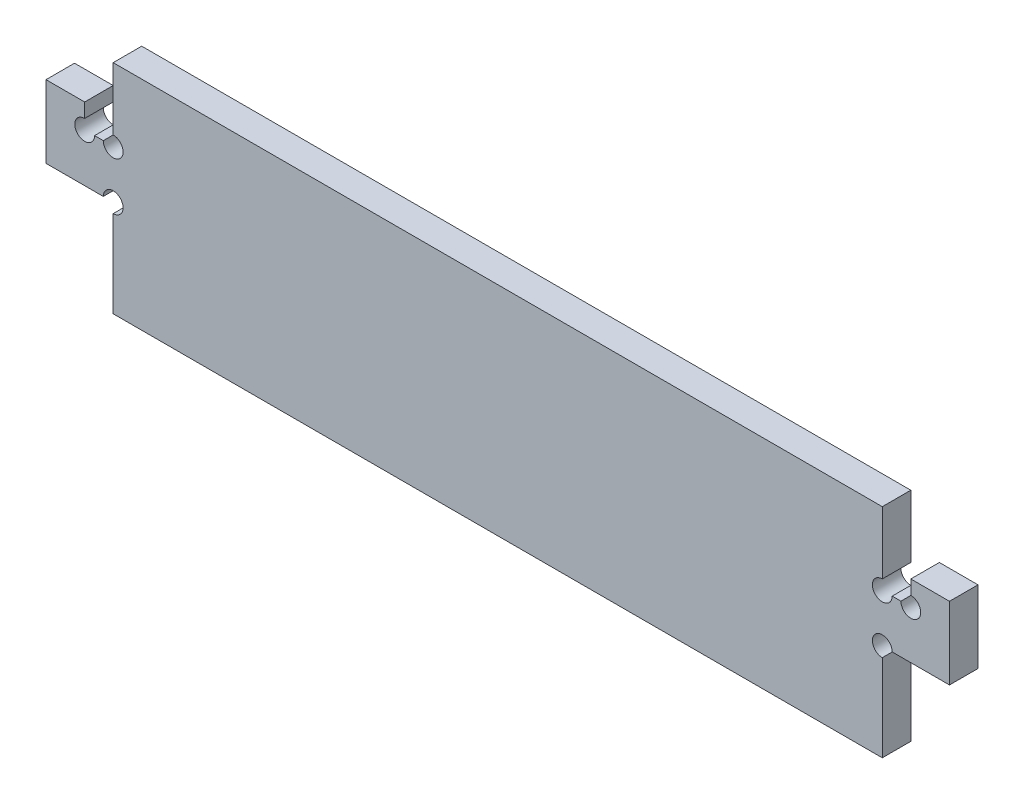
ISO-10303-21;
HEADER;
FILE_DESCRIPTION(('STEP AP214'),'2;1');
FILE_NAME('part.step','',(''),(''),'','','');
FILE_SCHEMA(('AUTOMOTIVE_DESIGN { 1 0 10303 214 1 1 1 1 }'));
ENDSEC;
DATA;
#1=APPLICATION_CONTEXT('core data for automotive mechanical design processes');
#2=APPLICATION_PROTOCOL_DEFINITION('international standard','automotive_design',2000,#1);
#3=PRODUCT_CONTEXT('',#1,'mechanical');
#4=PRODUCT('Part','Part','',(#3));
#5=PRODUCT_RELATED_PRODUCT_CATEGORY('part','',(#4));
#6=PRODUCT_DEFINITION_FORMATION('','',#4);
#7=PRODUCT_DEFINITION_CONTEXT('part definition',#1,'design');
#8=PRODUCT_DEFINITION('design','',#6,#7);
#9=PRODUCT_DEFINITION_SHAPE('','',#8);
#10=(LENGTH_UNIT() NAMED_UNIT(*) SI_UNIT(.MILLI.,.METRE.));
#11=(NAMED_UNIT(*) PLANE_ANGLE_UNIT() SI_UNIT($,.RADIAN.));
#12=(NAMED_UNIT(*) SI_UNIT($,.STERADIAN.) SOLID_ANGLE_UNIT());
#13=UNCERTAINTY_MEASURE_WITH_UNIT(LENGTH_MEASURE(1.E-05),#10,'distance_accuracy_value','');
#14=(GEOMETRIC_REPRESENTATION_CONTEXT(3) GLOBAL_UNCERTAINTY_ASSIGNED_CONTEXT((#13)) GLOBAL_UNIT_ASSIGNED_CONTEXT((#10,
#11,#12)) REPRESENTATION_CONTEXT('',''));
#15=CARTESIAN_POINT('',(0.,0.,0.));
#16=DIRECTION('',(0.,0.,1.));
#17=DIRECTION('',(1.,0.,0.));
#18=AXIS2_PLACEMENT_3D('',#15,#16,#17);
#19=CARTESIAN_POINT('',(79.55,-22.5,5.9));
#20=DIRECTION('',(-1.,0.,0.));
#21=DIRECTION('',(0.,0.,1.));
#22=AXIS2_PLACEMENT_3D('',#19,#20,#21);
#23=PLANE('',#22);
#24=DIRECTION('',(0.,1.,0.));
#25=VECTOR('',#24,1.);
#26=CARTESIAN_POINT('',(79.55,-22.5,5.9));
#27=LINE('',#26,#25);
#28=CARTESIAN_POINT('',(79.55,9.54999999999999,5.9));
#29=VERTEX_POINT('',#28);
#30=CARTESIAN_POINT('',(79.55,22.5,5.9));
#31=VERTEX_POINT('',#30);
#32=EDGE_CURVE('E216',#29,#31,#27,.T.);
#33=ORIENTED_EDGE('',*,*,#32,.F.);
#34=DIRECTION('',(0.,0.,1.));
#35=VECTOR('',#34,1.);
#36=CARTESIAN_POINT('',(79.55,9.55,-0.00100000000000013));
#37=LINE('',#36,#35);
#38=CARTESIAN_POINT('',(79.55,9.55,0.));
#39=VERTEX_POINT('',#38);
#40=EDGE_CURVE('E261',#39,#29,#37,.T.);
#41=ORIENTED_EDGE('',*,*,#40,.F.);
#42=DIRECTION('',(0.,1.,0.));
#43=VECTOR('',#42,1.);
#44=CARTESIAN_POINT('',(79.55,-22.5,0.));
#45=LINE('',#44,#43);
#46=CARTESIAN_POINT('',(79.55,22.5,0.));
#47=VERTEX_POINT('',#46);
#48=EDGE_CURVE('E229',#39,#47,#45,.T.);
#49=ORIENTED_EDGE('',*,*,#48,.T.);
#50=DIRECTION('',(0.,0.,-1.));
#51=VECTOR('',#50,1.);
#52=CARTESIAN_POINT('',(79.55,22.5,5.9));
#53=LINE('',#52,#51);
#54=EDGE_CURVE('E234',#31,#47,#53,.T.);
#55=ORIENTED_EDGE('',*,*,#54,.F.);
#56=EDGE_LOOP('',(#33,#41,#49,#55));
#57=FACE_BOUND('',#56,.T.);
#58=ADVANCED_FACE('F36',(#57),#23,.F.);
#59=CARTESIAN_POINT('',(-79.55,-22.5,5.9));
#60=DIRECTION('',(1.,0.,0.));
#61=DIRECTION('',(0.,0.,-1.));
#62=AXIS2_PLACEMENT_3D('',#59,#60,#61);
#63=PLANE('',#62);
#64=DIRECTION('',(0.,-1.,0.));
#65=VECTOR('',#64,1.);
#66=CARTESIAN_POINT('',(-79.55,-22.5,5.9));
#67=LINE('',#66,#65);
#68=CARTESIAN_POINT('',(-79.55,-4.54999999999996,5.9));
#69=VERTEX_POINT('',#68);
#70=CARTESIAN_POINT('',(-79.55,-22.5,5.9));
#71=VERTEX_POINT('',#70);
#72=EDGE_CURVE('E196',#69,#71,#67,.T.);
#73=ORIENTED_EDGE('',*,*,#72,.F.);
#74=DIRECTION('',(0.,0.,1.));
#75=VECTOR('',#74,1.);
#76=CARTESIAN_POINT('',(-79.55,-4.54999999999995,-0.00100000000000013));
#77=LINE('',#76,#75);
#78=CARTESIAN_POINT('',(-79.55,-4.54999999999995,0.));
#79=VERTEX_POINT('',#78);
#80=EDGE_CURVE('E183',#79,#69,#77,.T.);
#81=ORIENTED_EDGE('',*,*,#80,.F.);
#82=DIRECTION('',(0.,-1.,0.));
#83=VECTOR('',#82,1.);
#84=CARTESIAN_POINT('',(-79.55,-22.5,0.));
#85=LINE('',#84,#83);
#86=CARTESIAN_POINT('',(-79.55,-22.5,0.));
#87=VERTEX_POINT('',#86);
#88=EDGE_CURVE('E227',#79,#87,#85,.T.);
#89=ORIENTED_EDGE('',*,*,#88,.T.);
#90=DIRECTION('',(0.,0.,-1.));
#91=VECTOR('',#90,1.);
#92=CARTESIAN_POINT('',(-79.55,-22.5,5.9));
#93=LINE('',#92,#91);
#94=EDGE_CURVE('E11',#71,#87,#93,.T.);
#95=ORIENTED_EDGE('',*,*,#94,.F.);
#96=EDGE_LOOP('',(#73,#81,#89,#95));
#97=FACE_BOUND('',#96,.T.);
#98=ADVANCED_FACE('F203',(#97),#63,.F.);
#99=CARTESIAN_POINT('',(-79.55,22.5,0.));
#100=VERTEX_POINT('',#99);
#101=CARTESIAN_POINT('',(-79.55,9.54999999999999,0.));
#102=VERTEX_POINT('',#101);
#103=EDGE_CURVE('E223',#100,#102,#85,.T.);
#104=ORIENTED_EDGE('',*,*,#103,.T.);
#105=DIRECTION('',(0.,0.,1.));
#106=VECTOR('',#105,1.);
#107=CARTESIAN_POINT('',(-79.55,9.54999999999999,-0.00100000000000013));
#108=LINE('',#107,#106);
#109=CARTESIAN_POINT('',(-79.55,9.54999999999998,5.9));
#110=VERTEX_POINT('',#109);
#111=EDGE_CURVE('E294',#110,#102,#108,.F.);
#112=ORIENTED_EDGE('',*,*,#111,.F.);
#113=CARTESIAN_POINT('',(-79.55,22.5,5.9));
#114=VERTEX_POINT('',#113);
#115=EDGE_CURVE('E204',#114,#110,#67,.T.);
#116=ORIENTED_EDGE('',*,*,#115,.F.);
#117=DIRECTION('',(0.,0.,-1.));
#118=VECTOR('',#117,1.);
#119=CARTESIAN_POINT('',(-79.55,22.5,5.9));
#120=LINE('',#119,#118);
#121=EDGE_CURVE('E222',#114,#100,#120,.T.);
#122=ORIENTED_EDGE('',*,*,#121,.T.);
#123=EDGE_LOOP('',(#104,#112,#116,#122));
#124=FACE_BOUND('',#123,.T.);
#125=ADVANCED_FACE('F38',(#124),#63,.F.);
#126=CARTESIAN_POINT('',(79.55,-22.5,5.9));
#127=DIRECTION('',(0.,1.,0.));
#128=DIRECTION('',(-1.,0.,0.));
#129=AXIS2_PLACEMENT_3D('',#126,#127,#128);
#130=PLANE('',#129);
#131=DIRECTION('',(1.,0.,0.));
#132=VECTOR('',#131,1.);
#133=CARTESIAN_POINT('',(79.55,-22.5,0.));
#134=LINE('',#133,#132);
#135=CARTESIAN_POINT('',(79.55,-22.5,0.));
#136=VERTEX_POINT('',#135);
#137=EDGE_CURVE('E226',#87,#136,#134,.T.);
#138=ORIENTED_EDGE('',*,*,#137,.T.);
#139=DIRECTION('',(0.,0.,-1.));
#140=VECTOR('',#139,1.);
#141=CARTESIAN_POINT('',(79.55,-22.5,5.9));
#142=LINE('',#141,#140);
#143=CARTESIAN_POINT('',(79.55,-22.5,5.9));
#144=VERTEX_POINT('',#143);
#145=EDGE_CURVE('E44',#144,#136,#142,.T.);
#146=ORIENTED_EDGE('',*,*,#145,.F.);
#147=DIRECTION('',(1.,0.,0.));
#148=VECTOR('',#147,1.);
#149=CARTESIAN_POINT('',(79.55,-22.5,5.9));
#150=LINE('',#149,#148);
#151=EDGE_CURVE('E208',#71,#144,#150,.T.);
#152=ORIENTED_EDGE('',*,*,#151,.F.);
#153=ORIENTED_EDGE('',*,*,#94,.T.);
#154=EDGE_LOOP('',(#138,#146,#152,#153));
#155=FACE_BOUND('',#154,.T.);
#156=ADVANCED_FACE('F402',(#155),#130,.F.);
#157=CARTESIAN_POINT('',(79.55,-4.54999999999995,0.));
#158=VERTEX_POINT('',#157);
#159=EDGE_CURVE('E209',#136,#158,#45,.T.);
#160=ORIENTED_EDGE('',*,*,#159,.T.);
#161=DIRECTION('',(0.,0.,1.));
#162=VECTOR('',#161,1.);
#163=CARTESIAN_POINT('',(79.55,-4.54999999999995,-0.00100000000000013));
#164=LINE('',#163,#162);
#165=CARTESIAN_POINT('',(79.55,-4.54999999999996,5.9));
#166=VERTEX_POINT('',#165);
#167=EDGE_CURVE('E258',#166,#158,#164,.F.);
#168=ORIENTED_EDGE('',*,*,#167,.F.);
#169=EDGE_CURVE('E217',#144,#166,#27,.T.);
#170=ORIENTED_EDGE('',*,*,#169,.F.);
#171=ORIENTED_EDGE('',*,*,#145,.T.);
#172=EDGE_LOOP('',(#160,#168,#170,#171));
#173=FACE_BOUND('',#172,.T.);
#174=ADVANCED_FACE('F241',(#173),#23,.F.);
#175=CARTESIAN_POINT('',(79.55,22.5,5.9));
#176=DIRECTION('',(0.,-1.,0.));
#177=DIRECTION('',(1.,0.,0.));
#178=AXIS2_PLACEMENT_3D('',#175,#176,#177);
#179=PLANE('',#178);
#180=DIRECTION('',(-1.,0.,0.));
#181=VECTOR('',#180,1.);
#182=CARTESIAN_POINT('',(79.55,22.5,0.));
#183=LINE('',#182,#181);
#184=EDGE_CURVE('E205',#47,#100,#183,.T.);
#185=ORIENTED_EDGE('',*,*,#184,.T.);
#186=ORIENTED_EDGE('',*,*,#121,.F.);
#187=DIRECTION('',(-1.,0.,0.));
#188=VECTOR('',#187,1.);
#189=CARTESIAN_POINT('',(79.55,22.5,5.9));
#190=LINE('',#189,#188);
#191=EDGE_CURVE('E220',#31,#114,#190,.T.);
#192=ORIENTED_EDGE('',*,*,#191,.F.);
#193=ORIENTED_EDGE('',*,*,#54,.T.);
#194=EDGE_LOOP('',(#185,#186,#192,#193));
#195=FACE_BOUND('',#194,.T.);
#196=ADVANCED_FACE('F401',(#195),#179,.F.);
#197=CARTESIAN_POINT('',(0.,0.,5.9));
#198=DIRECTION('',(0.,0.,1.));
#199=DIRECTION('',(1.,0.,0.));
#200=AXIS2_PLACEMENT_3D('',#197,#198,#199);
#201=PLANE('',#200);
#202=CARTESIAN_POINT('',(85.45,7.50000000000001,5.9));
#203=DIRECTION('',(0.,0.,1.));
#204=DIRECTION('',(1.,0.,0.));
#205=AXIS2_PLACEMENT_3D('',#202,#203,#204);
#206=CIRCLE('',#205,2.04999999999999);
#207=CARTESIAN_POINT('',(83.4,7.50000000000001,5.9));
#208=VERTEX_POINT('',#207);
#209=CARTESIAN_POINT('',(85.45,9.55,5.9));
#210=VERTEX_POINT('',#209);
#211=EDGE_CURVE('E284',#208,#210,#206,.T.);
#212=ORIENTED_EDGE('',*,*,#211,.F.);
#213=DIRECTION('',(-1.,0.,0.));
#214=VECTOR('',#213,1.);
#215=CARTESIAN_POINT('',(79.55,7.50000000000001,5.9));
#216=LINE('',#215,#214);
#217=CARTESIAN_POINT('',(81.6,7.50000000000001,5.9));
#218=VERTEX_POINT('',#217);
#219=EDGE_CURVE('E320',#208,#218,#216,.T.);
#220=ORIENTED_EDGE('',*,*,#219,.T.);
#221=CARTESIAN_POINT('',(79.55,7.50000000000001,5.9));
#222=DIRECTION('',(0.,0.,1.));
#223=DIRECTION('',(1.,0.,0.));
#224=AXIS2_PLACEMENT_3D('',#221,#222,#223);
#225=CIRCLE('',#224,2.04999999999999);
#226=EDGE_CURVE('E270',#29,#218,#225,.T.);
#227=ORIENTED_EDGE('',*,*,#226,.F.);
#228=ORIENTED_EDGE('',*,*,#32,.T.);
#229=ORIENTED_EDGE('',*,*,#191,.T.);
#230=ORIENTED_EDGE('',*,*,#115,.T.);
#231=CARTESIAN_POINT('',(-79.55,7.5,5.9));
#232=DIRECTION('',(0.,0.,1.));
#233=DIRECTION('',(1.,0.,0.));
#234=AXIS2_PLACEMENT_3D('',#231,#232,#233);
#235=CIRCLE('',#234,2.04999999999999);
#236=CARTESIAN_POINT('',(-81.6,7.50000000000001,5.9));
#237=VERTEX_POINT('',#236);
#238=EDGE_CURVE('E296',#237,#110,#235,.T.);
#239=ORIENTED_EDGE('',*,*,#238,.F.);
#240=DIRECTION('',(-1.,0.,0.));
#241=VECTOR('',#240,1.);
#242=CARTESIAN_POINT('',(-79.55,7.50000000000001,5.9));
#243=LINE('',#242,#241);
#244=CARTESIAN_POINT('',(-83.4,7.50000000000001,5.9));
#245=VERTEX_POINT('',#244);
#246=EDGE_CURVE('E330',#237,#245,#243,.T.);
#247=ORIENTED_EDGE('',*,*,#246,.T.);
#248=CARTESIAN_POINT('',(-85.45,7.50000000000001,5.9));
#249=DIRECTION('',(0.,0.,1.));
#250=DIRECTION('',(1.,0.,0.));
#251=AXIS2_PLACEMENT_3D('',#248,#249,#250);
#252=CIRCLE('',#251,2.04999999999999);
#253=CARTESIAN_POINT('',(-85.45,9.55,5.9));
#254=VERTEX_POINT('',#253);
#255=EDGE_CURVE('E59',#254,#245,#252,.T.);
#256=ORIENTED_EDGE('',*,*,#255,.F.);
#257=DIRECTION('',(0.,1.,0.));
#258=VECTOR('',#257,1.);
#259=CARTESIAN_POINT('',(-85.45,7.50000000000001,5.9));
#260=LINE('',#259,#258);
#261=CARTESIAN_POINT('',(-85.45,12.5,5.9));
#262=VERTEX_POINT('',#261);
#263=EDGE_CURVE('E343',#254,#262,#260,.T.);
#264=ORIENTED_EDGE('',*,*,#263,.T.);
#265=DIRECTION('',(-1.,0.,0.));
#266=VECTOR('',#265,1.);
#267=CARTESIAN_POINT('',(-85.45,12.5,5.9));
#268=LINE('',#267,#266);
#269=CARTESIAN_POINT('',(-93.45,12.5,5.9));
#270=VERTEX_POINT('',#269);
#271=EDGE_CURVE('E345',#262,#270,#268,.T.);
#272=ORIENTED_EDGE('',*,*,#271,.T.);
#273=DIRECTION('',(0.,-1.,0.));
#274=VECTOR('',#273,1.);
#275=CARTESIAN_POINT('',(-93.45,12.5,5.9));
#276=LINE('',#275,#274);
#277=CARTESIAN_POINT('',(-93.45,-2.49999999999996,5.9));
#278=VERTEX_POINT('',#277);
#279=EDGE_CURVE('E348',#270,#278,#276,.T.);
#280=ORIENTED_EDGE('',*,*,#279,.T.);
#281=DIRECTION('',(1.,0.,0.));
#282=VECTOR('',#281,1.);
#283=CARTESIAN_POINT('',(-85.45,-2.49999999999996,5.9));
#284=LINE('',#283,#282);
#285=CARTESIAN_POINT('',(-81.6,-2.49999999999996,5.9));
#286=VERTEX_POINT('',#285);
#287=EDGE_CURVE('E200',#278,#286,#284,.T.);
#288=ORIENTED_EDGE('',*,*,#287,.T.);
#289=CARTESIAN_POINT('',(-79.55,-2.49999999999996,5.9));
#290=DIRECTION('',(0.,0.,1.));
#291=DIRECTION('',(1.,0.,0.));
#292=AXIS2_PLACEMENT_3D('',#289,#290,#291);
#293=CIRCLE('',#292,2.04999999999999);
#294=EDGE_CURVE('E51',#69,#286,#293,.T.);
#295=ORIENTED_EDGE('',*,*,#294,.F.);
#296=ORIENTED_EDGE('',*,*,#72,.T.);
#297=ORIENTED_EDGE('',*,*,#151,.T.);
#298=ORIENTED_EDGE('',*,*,#169,.T.);
#299=CARTESIAN_POINT('',(79.55,-2.49999999999996,5.9));
#300=DIRECTION('',(0.,0.,1.));
#301=DIRECTION('',(1.,0.,0.));
#302=AXIS2_PLACEMENT_3D('',#299,#300,#301);
#303=CIRCLE('',#302,2.04999999999999);
#304=CARTESIAN_POINT('',(81.6,-2.49999999999996,5.9));
#305=VERTEX_POINT('',#304);
#306=EDGE_CURVE('E255',#305,#166,#303,.T.);
#307=ORIENTED_EDGE('',*,*,#306,.F.);
#308=DIRECTION('',(1.,0.,0.));
#309=VECTOR('',#308,1.);
#310=CARTESIAN_POINT('',(93.45,-2.49999999999996,5.9));
#311=LINE('',#310,#309);
#312=CARTESIAN_POINT('',(93.45,-2.49999999999996,5.9));
#313=VERTEX_POINT('',#312);
#314=EDGE_CURVE('E300',#305,#313,#311,.T.);
#315=ORIENTED_EDGE('',*,*,#314,.T.);
#316=DIRECTION('',(0.,1.,0.));
#317=VECTOR('',#316,1.);
#318=CARTESIAN_POINT('',(93.45,12.5,5.9));
#319=LINE('',#318,#317);
#320=CARTESIAN_POINT('',(93.45,12.5,5.9));
#321=VERTEX_POINT('',#320);
#322=EDGE_CURVE('E311',#313,#321,#319,.T.);
#323=ORIENTED_EDGE('',*,*,#322,.T.);
#324=DIRECTION('',(-1.,0.,0.));
#325=VECTOR('',#324,1.);
#326=CARTESIAN_POINT('',(85.45,12.5,5.9));
#327=LINE('',#326,#325);
#328=CARTESIAN_POINT('',(85.45,12.5,5.9));
#329=VERTEX_POINT('',#328);
#330=EDGE_CURVE('E314',#321,#329,#327,.T.);
#331=ORIENTED_EDGE('',*,*,#330,.T.);
#332=DIRECTION('',(0.,-1.,0.));
#333=VECTOR('',#332,1.);
#334=CARTESIAN_POINT('',(85.45,7.50000000000001,5.9));
#335=LINE('',#334,#333);
#336=EDGE_CURVE('E317',#329,#210,#335,.T.);
#337=ORIENTED_EDGE('',*,*,#336,.T.);
#338=EDGE_LOOP('',(#212,#220,#227,#228,#229,#230,#239,#247,#256,#264,#272,#280,#288,#295,#296,
#297,#298,#307,#315,#323,#331,#337));
#339=FACE_BOUND('',#338,.T.);
#340=ADVANCED_FACE('F195',(#339),#201,.T.);
#341=CARTESIAN_POINT('',(0.,0.,0.));
#342=DIRECTION('',(0.,0.,1.));
#343=DIRECTION('',(1.,0.,0.));
#344=AXIS2_PLACEMENT_3D('',#341,#342,#343);
#345=PLANE('',#344);
#346=DIRECTION('',(1.,0.,0.));
#347=VECTOR('',#346,1.);
#348=CARTESIAN_POINT('',(79.55,7.50000000000001,0.));
#349=LINE('',#348,#347);
#350=CARTESIAN_POINT('',(81.6,7.50000000000001,0.));
#351=VERTEX_POINT('',#350);
#352=CARTESIAN_POINT('',(83.4,7.50000000000001,0.));
#353=VERTEX_POINT('',#352);
#354=EDGE_CURVE('E308',#351,#353,#349,.T.);
#355=ORIENTED_EDGE('',*,*,#354,.T.);
#356=CARTESIAN_POINT('',(85.45,7.50000000000001,0.));
#357=DIRECTION('',(0.,0.,1.));
#358=DIRECTION('',(1.,0.,0.));
#359=AXIS2_PLACEMENT_3D('',#356,#357,#358);
#360=CIRCLE('',#359,2.04999999999999);
#361=CARTESIAN_POINT('',(85.45,9.55,0.));
#362=VERTEX_POINT('',#361);
#363=EDGE_CURVE('E282',#362,#353,#360,.F.);
#364=ORIENTED_EDGE('',*,*,#363,.F.);
#365=DIRECTION('',(0.,1.,0.));
#366=VECTOR('',#365,1.);
#367=CARTESIAN_POINT('',(85.45,7.50000000000001,0.));
#368=LINE('',#367,#366);
#369=CARTESIAN_POINT('',(85.45,12.5,0.));
#370=VERTEX_POINT('',#369);
#371=EDGE_CURVE('E306',#362,#370,#368,.T.);
#372=ORIENTED_EDGE('',*,*,#371,.T.);
#373=DIRECTION('',(1.,0.,0.));
#374=VECTOR('',#373,1.);
#375=CARTESIAN_POINT('',(85.45,12.5,0.));
#376=LINE('',#375,#374);
#377=CARTESIAN_POINT('',(93.45,12.5,0.));
#378=VERTEX_POINT('',#377);
#379=EDGE_CURVE('E303',#370,#378,#376,.T.);
#380=ORIENTED_EDGE('',*,*,#379,.T.);
#381=DIRECTION('',(0.,-1.,0.));
#382=VECTOR('',#381,1.);
#383=CARTESIAN_POINT('',(93.45,12.5,0.));
#384=LINE('',#383,#382);
#385=CARTESIAN_POINT('',(93.45,-2.49999999999996,0.));
#386=VERTEX_POINT('',#385);
#387=EDGE_CURVE('E301',#378,#386,#384,.T.);
#388=ORIENTED_EDGE('',*,*,#387,.T.);
#389=DIRECTION('',(-1.,0.,0.));
#390=VECTOR('',#389,1.);
#391=CARTESIAN_POINT('',(93.45,-2.49999999999996,0.));
#392=LINE('',#391,#390);
#393=CARTESIAN_POINT('',(81.6,-2.49999999999996,0.));
#394=VERTEX_POINT('',#393);
#395=EDGE_CURVE('E252',#386,#394,#392,.T.);
#396=ORIENTED_EDGE('',*,*,#395,.T.);
#397=CARTESIAN_POINT('',(79.55,-2.49999999999996,0.));
#398=DIRECTION('',(0.,0.,1.));
#399=DIRECTION('',(1.,0.,0.));
#400=AXIS2_PLACEMENT_3D('',#397,#398,#399);
#401=CIRCLE('',#400,2.04999999999999);
#402=EDGE_CURVE('E250',#158,#394,#401,.F.);
#403=ORIENTED_EDGE('',*,*,#402,.F.);
#404=ORIENTED_EDGE('',*,*,#159,.F.);
#405=ORIENTED_EDGE('',*,*,#137,.F.);
#406=ORIENTED_EDGE('',*,*,#88,.F.);
#407=CARTESIAN_POINT('',(-79.55,-2.49999999999996,0.));
#408=DIRECTION('',(0.,0.,1.));
#409=DIRECTION('',(1.,0.,0.));
#410=AXIS2_PLACEMENT_3D('',#407,#408,#409);
#411=CIRCLE('',#410,2.04999999999999);
#412=CARTESIAN_POINT('',(-81.6,-2.49999999999996,0.));
#413=VERTEX_POINT('',#412);
#414=EDGE_CURVE('E186',#413,#79,#411,.F.);
#415=ORIENTED_EDGE('',*,*,#414,.F.);
#416=DIRECTION('',(-1.,0.,0.));
#417=VECTOR('',#416,1.);
#418=CARTESIAN_POINT('',(-85.45,-2.49999999999996,0.));
#419=LINE('',#418,#417);
#420=CARTESIAN_POINT('',(-93.45,-2.49999999999996,0.));
#421=VERTEX_POINT('',#420);
#422=EDGE_CURVE('E339',#413,#421,#419,.T.);
#423=ORIENTED_EDGE('',*,*,#422,.T.);
#424=DIRECTION('',(0.,1.,0.));
#425=VECTOR('',#424,1.);
#426=CARTESIAN_POINT('',(-93.45,12.5,0.));
#427=LINE('',#426,#425);
#428=CARTESIAN_POINT('',(-93.45,12.5,0.));
#429=VERTEX_POINT('',#428);
#430=EDGE_CURVE('E337',#421,#429,#427,.T.);
#431=ORIENTED_EDGE('',*,*,#430,.T.);
#432=DIRECTION('',(1.,0.,0.));
#433=VECTOR('',#432,1.);
#434=CARTESIAN_POINT('',(-85.45,12.5,0.));
#435=LINE('',#434,#433);
#436=CARTESIAN_POINT('',(-85.45,12.5,0.));
#437=VERTEX_POINT('',#436);
#438=EDGE_CURVE('E334',#429,#437,#435,.T.);
#439=ORIENTED_EDGE('',*,*,#438,.T.);
#440=DIRECTION('',(0.,-1.,0.));
#441=VECTOR('',#440,1.);
#442=CARTESIAN_POINT('',(-85.45,7.50000000000001,0.));
#443=LINE('',#442,#441);
#444=CARTESIAN_POINT('',(-85.45,9.55,0.));
#445=VERTEX_POINT('',#444);
#446=EDGE_CURVE('E331',#437,#445,#443,.T.);
#447=ORIENTED_EDGE('',*,*,#446,.T.);
#448=CARTESIAN_POINT('',(-85.45,7.50000000000001,0.));
#449=DIRECTION('',(0.,0.,1.));
#450=DIRECTION('',(1.,0.,0.));
#451=AXIS2_PLACEMENT_3D('',#448,#449,#450);
#452=CIRCLE('',#451,2.04999999999999);
#453=CARTESIAN_POINT('',(-83.4,7.50000000000001,0.));
#454=VERTEX_POINT('',#453);
#455=EDGE_CURVE('E274',#454,#445,#452,.F.);
#456=ORIENTED_EDGE('',*,*,#455,.F.);
#457=DIRECTION('',(1.,0.,0.));
#458=VECTOR('',#457,1.);
#459=CARTESIAN_POINT('',(-79.55,7.50000000000001,0.));
#460=LINE('',#459,#458);
#461=CARTESIAN_POINT('',(-81.6,7.50000000000001,0.));
#462=VERTEX_POINT('',#461);
#463=EDGE_CURVE('E213',#454,#462,#460,.T.);
#464=ORIENTED_EDGE('',*,*,#463,.T.);
#465=CARTESIAN_POINT('',(-79.55,7.5,0.));
#466=DIRECTION('',(0.,0.,1.));
#467=DIRECTION('',(1.,0.,0.));
#468=AXIS2_PLACEMENT_3D('',#465,#466,#467);
#469=CIRCLE('',#468,2.04999999999999);
#470=EDGE_CURVE('E298',#102,#462,#469,.F.);
#471=ORIENTED_EDGE('',*,*,#470,.F.);
#472=ORIENTED_EDGE('',*,*,#103,.F.);
#473=ORIENTED_EDGE('',*,*,#184,.F.);
#474=ORIENTED_EDGE('',*,*,#48,.F.);
#475=CARTESIAN_POINT('',(79.55,7.50000000000001,0.));
#476=DIRECTION('',(0.,0.,1.));
#477=DIRECTION('',(1.,0.,0.));
#478=AXIS2_PLACEMENT_3D('',#475,#476,#477);
#479=CIRCLE('',#478,2.04999999999999);
#480=EDGE_CURVE('E268',#351,#39,#479,.F.);
#481=ORIENTED_EDGE('',*,*,#480,.F.);
#482=EDGE_LOOP('',(#355,#364,#372,#380,#388,#396,#403,#404,#405,#406,#415,#423,#431,#439,#447,
#456,#464,#471,#472,#473,#474,#481));
#483=FACE_BOUND('',#482,.T.);
#484=ADVANCED_FACE('F248',(#483),#345,.F.);
#485=CARTESIAN_POINT('',(-85.45,-2.49999999999996,-20.450183373261));
#486=DIRECTION('',(0.,-1.,0.));
#487=DIRECTION('',(0.,0.,-1.));
#488=AXIS2_PLACEMENT_3D('',#485,#486,#487);
#489=PLANE('',#488);
#490=DIRECTION('',(0.,0.,1.));
#491=VECTOR('',#490,1.);
#492=CARTESIAN_POINT('',(-81.6,-2.49999999999996,-0.00100000000000013));
#493=LINE('',#492,#491);
#494=EDGE_CURVE('E190',#413,#286,#493,.T.);
#495=ORIENTED_EDGE('',*,*,#494,.T.);
#496=ORIENTED_EDGE('',*,*,#287,.F.);
#497=DIRECTION('',(0.,0.,1.));
#498=VECTOR('',#497,1.);
#499=CARTESIAN_POINT('',(-93.45,-2.49999999999996,-20.450183373261));
#500=LINE('',#499,#498);
#501=EDGE_CURVE('E335',#421,#278,#500,.T.);
#502=ORIENTED_EDGE('',*,*,#501,.F.);
#503=ORIENTED_EDGE('',*,*,#422,.F.);
#504=EDGE_LOOP('',(#495,#496,#502,#503));
#505=FACE_BOUND('',#504,.T.);
#506=ADVANCED_FACE('F381',(#505),#489,.T.);
#507=CARTESIAN_POINT('',(-93.45,12.5,-20.450183373261));
#508=DIRECTION('',(-1.,0.,0.));
#509=DIRECTION('',(0.,0.,1.));
#510=AXIS2_PLACEMENT_3D('',#507,#508,#509);
#511=PLANE('',#510);
#512=ORIENTED_EDGE('',*,*,#430,.F.);
#513=ORIENTED_EDGE('',*,*,#501,.T.);
#514=ORIENTED_EDGE('',*,*,#279,.F.);
#515=DIRECTION('',(0.,0.,1.));
#516=VECTOR('',#515,1.);
#517=CARTESIAN_POINT('',(-93.45,12.5,-20.450183373261));
#518=LINE('',#517,#516);
#519=EDGE_CURVE('E353',#429,#270,#518,.T.);
#520=ORIENTED_EDGE('',*,*,#519,.F.);
#521=EDGE_LOOP('',(#512,#513,#514,#520));
#522=FACE_BOUND('',#521,.T.);
#523=ADVANCED_FACE('F377',(#522),#511,.T.);
#524=CARTESIAN_POINT('',(-85.45,12.5,-20.450183373261));
#525=DIRECTION('',(0.,1.,0.));
#526=DIRECTION('',(0.,0.,1.));
#527=AXIS2_PLACEMENT_3D('',#524,#525,#526);
#528=PLANE('',#527);
#529=ORIENTED_EDGE('',*,*,#438,.F.);
#530=ORIENTED_EDGE('',*,*,#519,.T.);
#531=ORIENTED_EDGE('',*,*,#271,.F.);
#532=DIRECTION('',(0.,0.,1.));
#533=VECTOR('',#532,1.);
#534=CARTESIAN_POINT('',(-85.45,12.5,-20.450183373261));
#535=LINE('',#534,#533);
#536=EDGE_CURVE('E351',#437,#262,#535,.T.);
#537=ORIENTED_EDGE('',*,*,#536,.F.);
#538=EDGE_LOOP('',(#529,#530,#531,#537));
#539=FACE_BOUND('',#538,.T.);
#540=ADVANCED_FACE('F363',(#539),#528,.T.);
#541=CARTESIAN_POINT('',(-85.45,7.50000000000001,-20.450183373261));
#542=DIRECTION('',(1.,0.,0.));
#543=DIRECTION('',(0.,0.,-1.));
#544=AXIS2_PLACEMENT_3D('',#541,#542,#543);
#545=PLANE('',#544);
#546=DIRECTION('',(0.,0.,1.));
#547=VECTOR('',#546,1.);
#548=CARTESIAN_POINT('',(-85.45,9.55,-0.00100000000000013));
#549=LINE('',#548,#547);
#550=EDGE_CURVE('E278',#254,#445,#549,.F.);
#551=ORIENTED_EDGE('',*,*,#550,.T.);
#552=ORIENTED_EDGE('',*,*,#446,.F.);
#553=ORIENTED_EDGE('',*,*,#536,.T.);
#554=ORIENTED_EDGE('',*,*,#263,.F.);
#555=EDGE_LOOP('',(#551,#552,#553,#554));
#556=FACE_BOUND('',#555,.T.);
#557=ADVANCED_FACE('F360',(#556),#545,.T.);
#558=CARTESIAN_POINT('',(-79.55,7.50000000000001,-20.450183373261));
#559=DIRECTION('',(0.,1.,0.));
#560=DIRECTION('',(-1.,0.,0.));
#561=AXIS2_PLACEMENT_3D('',#558,#559,#560);
#562=PLANE('',#561);
#563=DIRECTION('',(0.,0.,1.));
#564=VECTOR('',#563,1.);
#565=CARTESIAN_POINT('',(-83.4,7.50000000000001,-0.00100000000000013));
#566=LINE('',#565,#564);
#567=EDGE_CURVE('E271',#454,#245,#566,.T.);
#568=ORIENTED_EDGE('',*,*,#567,.T.);
#569=ORIENTED_EDGE('',*,*,#246,.F.);
#570=DIRECTION('',(0.,0.,1.));
#571=VECTOR('',#570,1.);
#572=CARTESIAN_POINT('',(-81.6,7.50000000000001,-0.00100000000000013));
#573=LINE('',#572,#571);
#574=EDGE_CURVE('E291',#237,#462,#573,.F.);
#575=ORIENTED_EDGE('',*,*,#574,.T.);
#576=ORIENTED_EDGE('',*,*,#463,.F.);
#577=EDGE_LOOP('',(#568,#569,#575,#576));
#578=FACE_BOUND('',#577,.T.);
#579=ADVANCED_FACE('F369',(#578),#562,.T.);
#580=CARTESIAN_POINT('',(79.55,7.50000000000001,-20.450183373261));
#581=DIRECTION('',(0.,1.,0.));
#582=DIRECTION('',(-1.,0.,0.));
#583=AXIS2_PLACEMENT_3D('',#580,#581,#582);
#584=PLANE('',#583);
#585=DIRECTION('',(0.,0.,1.));
#586=VECTOR('',#585,1.);
#587=CARTESIAN_POINT('',(83.4,7.50000000000001,-0.00100000000000013));
#588=LINE('',#587,#586);
#589=EDGE_CURVE('E286',#208,#353,#588,.F.);
#590=ORIENTED_EDGE('',*,*,#589,.T.);
#591=ORIENTED_EDGE('',*,*,#354,.F.);
#592=DIRECTION('',(0.,0.,1.));
#593=VECTOR('',#592,1.);
#594=CARTESIAN_POINT('',(81.6,7.50000000000001,-0.00100000000000013));
#595=LINE('',#594,#593);
#596=EDGE_CURVE('E256',#351,#218,#595,.T.);
#597=ORIENTED_EDGE('',*,*,#596,.T.);
#598=ORIENTED_EDGE('',*,*,#219,.F.);
#599=EDGE_LOOP('',(#590,#591,#597,#598));
#600=FACE_BOUND('',#599,.T.);
#601=ADVANCED_FACE('F438',(#600),#584,.T.);
#602=CARTESIAN_POINT('',(85.45,7.50000000000001,-20.450183373261));
#603=DIRECTION('',(-1.,0.,0.));
#604=DIRECTION('',(0.,0.,1.));
#605=AXIS2_PLACEMENT_3D('',#602,#603,#604);
#606=PLANE('',#605);
#607=DIRECTION('',(0.,0.,1.));
#608=VECTOR('',#607,1.);
#609=CARTESIAN_POINT('',(85.45,9.55,-0.00100000000000013));
#610=LINE('',#609,#608);
#611=EDGE_CURVE('E276',#362,#210,#610,.T.);
#612=ORIENTED_EDGE('',*,*,#611,.T.);
#613=ORIENTED_EDGE('',*,*,#336,.F.);
#614=DIRECTION('',(0.,0.,1.));
#615=VECTOR('',#614,1.);
#616=CARTESIAN_POINT('',(85.45,12.5,-20.450183373261));
#617=LINE('',#616,#615);
#618=EDGE_CURVE('E304',#370,#329,#617,.T.);
#619=ORIENTED_EDGE('',*,*,#618,.F.);
#620=ORIENTED_EDGE('',*,*,#371,.F.);
#621=EDGE_LOOP('',(#612,#613,#619,#620));
#622=FACE_BOUND('',#621,.T.);
#623=ADVANCED_FACE('F430',(#622),#606,.T.);
#624=CARTESIAN_POINT('',(85.45,12.5,-20.450183373261));
#625=DIRECTION('',(0.,1.,0.));
#626=DIRECTION('',(0.,0.,1.));
#627=AXIS2_PLACEMENT_3D('',#624,#625,#626);
#628=PLANE('',#627);
#629=ORIENTED_EDGE('',*,*,#379,.F.);
#630=ORIENTED_EDGE('',*,*,#618,.T.);
#631=ORIENTED_EDGE('',*,*,#330,.F.);
#632=DIRECTION('',(0.,0.,1.));
#633=VECTOR('',#632,1.);
#634=CARTESIAN_POINT('',(93.45,12.5,-20.450183373261));
#635=LINE('',#634,#633);
#636=EDGE_CURVE('E325',#378,#321,#635,.T.);
#637=ORIENTED_EDGE('',*,*,#636,.F.);
#638=EDGE_LOOP('',(#629,#630,#631,#637));
#639=FACE_BOUND('',#638,.T.);
#640=ADVANCED_FACE('F426',(#639),#628,.T.);
#641=CARTESIAN_POINT('',(93.45,12.5,-20.450183373261));
#642=DIRECTION('',(1.,0.,0.));
#643=DIRECTION('',(0.,0.,-1.));
#644=AXIS2_PLACEMENT_3D('',#641,#642,#643);
#645=PLANE('',#644);
#646=ORIENTED_EDGE('',*,*,#387,.F.);
#647=ORIENTED_EDGE('',*,*,#636,.T.);
#648=ORIENTED_EDGE('',*,*,#322,.F.);
#649=DIRECTION('',(0.,0.,1.));
#650=VECTOR('',#649,1.);
#651=CARTESIAN_POINT('',(93.45,-2.49999999999996,-20.450183373261));
#652=LINE('',#651,#650);
#653=EDGE_CURVE('E323',#386,#313,#652,.T.);
#654=ORIENTED_EDGE('',*,*,#653,.F.);
#655=EDGE_LOOP('',(#646,#647,#648,#654));
#656=FACE_BOUND('',#655,.T.);
#657=ADVANCED_FACE('F420',(#656),#645,.T.);
#658=CARTESIAN_POINT('',(93.45,-2.49999999999996,-20.450183373261));
#659=DIRECTION('',(0.,-1.,0.));
#660=DIRECTION('',(0.,0.,-1.));
#661=AXIS2_PLACEMENT_3D('',#658,#659,#660);
#662=PLANE('',#661);
#663=DIRECTION('',(0.,0.,1.));
#664=VECTOR('',#663,1.);
#665=CARTESIAN_POINT('',(81.6,-2.49999999999996,-0.00100000000000013));
#666=LINE('',#665,#664);
#667=EDGE_CURVE('E266',#305,#394,#666,.F.);
#668=ORIENTED_EDGE('',*,*,#667,.T.);
#669=ORIENTED_EDGE('',*,*,#395,.F.);
#670=ORIENTED_EDGE('',*,*,#653,.T.);
#671=ORIENTED_EDGE('',*,*,#314,.F.);
#672=EDGE_LOOP('',(#668,#669,#670,#671));
#673=FACE_BOUND('',#672,.T.);
#674=ADVANCED_FACE('F415',(#673),#662,.T.);
#675=CARTESIAN_POINT('',(79.55,-2.49999999999996,-0.00100000000000013));
#676=DIRECTION('',(0.,0.,1.));
#677=DIRECTION('',(1.,0.,0.));
#678=AXIS2_PLACEMENT_3D('',#675,#676,#677);
#679=CYLINDRICAL_SURFACE('',#678,2.04999999999999);
#680=ORIENTED_EDGE('',*,*,#167,.T.);
#681=ORIENTED_EDGE('',*,*,#402,.T.);
#682=ORIENTED_EDGE('',*,*,#667,.F.);
#683=ORIENTED_EDGE('',*,*,#306,.T.);
#684=EDGE_LOOP('',(#680,#681,#682,#683));
#685=FACE_BOUND('',#684,.T.);
#686=ADVANCED_FACE('F471',(#685),#679,.F.);
#687=CARTESIAN_POINT('',(85.45,7.50000000000001,-0.00100000000000013));
#688=DIRECTION('',(0.,0.,1.));
#689=DIRECTION('',(1.,0.,0.));
#690=AXIS2_PLACEMENT_3D('',#687,#688,#689);
#691=CYLINDRICAL_SURFACE('',#690,2.04999999999999);
#692=ORIENTED_EDGE('',*,*,#211,.T.);
#693=ORIENTED_EDGE('',*,*,#611,.F.);
#694=ORIENTED_EDGE('',*,*,#363,.T.);
#695=ORIENTED_EDGE('',*,*,#589,.F.);
#696=EDGE_LOOP('',(#692,#693,#694,#695));
#697=FACE_BOUND('',#696,.T.);
#698=ADVANCED_FACE('F433',(#697),#691,.F.);
#699=CARTESIAN_POINT('',(79.55,7.50000000000001,-0.00100000000000013));
#700=DIRECTION('',(0.,0.,1.));
#701=DIRECTION('',(1.,0.,0.));
#702=AXIS2_PLACEMENT_3D('',#699,#700,#701);
#703=CYLINDRICAL_SURFACE('',#702,2.04999999999999);
#704=ORIENTED_EDGE('',*,*,#40,.T.);
#705=ORIENTED_EDGE('',*,*,#226,.T.);
#706=ORIENTED_EDGE('',*,*,#596,.F.);
#707=ORIENTED_EDGE('',*,*,#480,.T.);
#708=EDGE_LOOP('',(#704,#705,#706,#707));
#709=FACE_BOUND('',#708,.T.);
#710=ADVANCED_FACE('F453',(#709),#703,.F.);
#711=CARTESIAN_POINT('',(-79.55,7.5,-0.00100000000000013));
#712=DIRECTION('',(0.,0.,1.));
#713=DIRECTION('',(1.,0.,0.));
#714=AXIS2_PLACEMENT_3D('',#711,#712,#713);
#715=CYLINDRICAL_SURFACE('',#714,2.04999999999999);
#716=ORIENTED_EDGE('',*,*,#111,.T.);
#717=ORIENTED_EDGE('',*,*,#470,.T.);
#718=ORIENTED_EDGE('',*,*,#574,.F.);
#719=ORIENTED_EDGE('',*,*,#238,.T.);
#720=EDGE_LOOP('',(#716,#717,#718,#719));
#721=FACE_BOUND('',#720,.T.);
#722=ADVANCED_FACE('F451',(#721),#715,.F.);
#723=CARTESIAN_POINT('',(-85.45,7.50000000000001,-0.00100000000000013));
#724=DIRECTION('',(0.,0.,1.));
#725=DIRECTION('',(1.,0.,0.));
#726=AXIS2_PLACEMENT_3D('',#723,#724,#725);
#727=CYLINDRICAL_SURFACE('',#726,2.04999999999999);
#728=ORIENTED_EDGE('',*,*,#255,.T.);
#729=ORIENTED_EDGE('',*,*,#567,.F.);
#730=ORIENTED_EDGE('',*,*,#455,.T.);
#731=ORIENTED_EDGE('',*,*,#550,.F.);
#732=EDGE_LOOP('',(#728,#729,#730,#731));
#733=FACE_BOUND('',#732,.T.);
#734=ADVANCED_FACE('F373',(#733),#727,.F.);
#735=CARTESIAN_POINT('',(-79.55,-2.49999999999996,-0.00100000000000013));
#736=DIRECTION('',(0.,0.,1.));
#737=DIRECTION('',(1.,0.,0.));
#738=AXIS2_PLACEMENT_3D('',#735,#736,#737);
#739=CYLINDRICAL_SURFACE('',#738,2.04999999999999);
#740=ORIENTED_EDGE('',*,*,#80,.T.);
#741=ORIENTED_EDGE('',*,*,#294,.T.);
#742=ORIENTED_EDGE('',*,*,#494,.F.);
#743=ORIENTED_EDGE('',*,*,#414,.T.);
#744=EDGE_LOOP('',(#740,#741,#742,#743));
#745=FACE_BOUND('',#744,.T.);
#746=ADVANCED_FACE('F184',(#745),#739,.F.);
#747=CLOSED_SHELL('',(#58,#98,#125,#156,#174,#196,#340,#484,#506,#523,#540,#557,#579,#601,#623,
#640,#657,#674,#686,#698,#710,#722,#734,#746));
#748=MANIFOLD_SOLID_BREP('B2',#747);
#749=ADVANCED_BREP_SHAPE_REPRESENTATION('',(#18,#748),#14);
#750=SHAPE_DEFINITION_REPRESENTATION(#9,#749);
ENDSEC;
END-ISO-10303-21;
